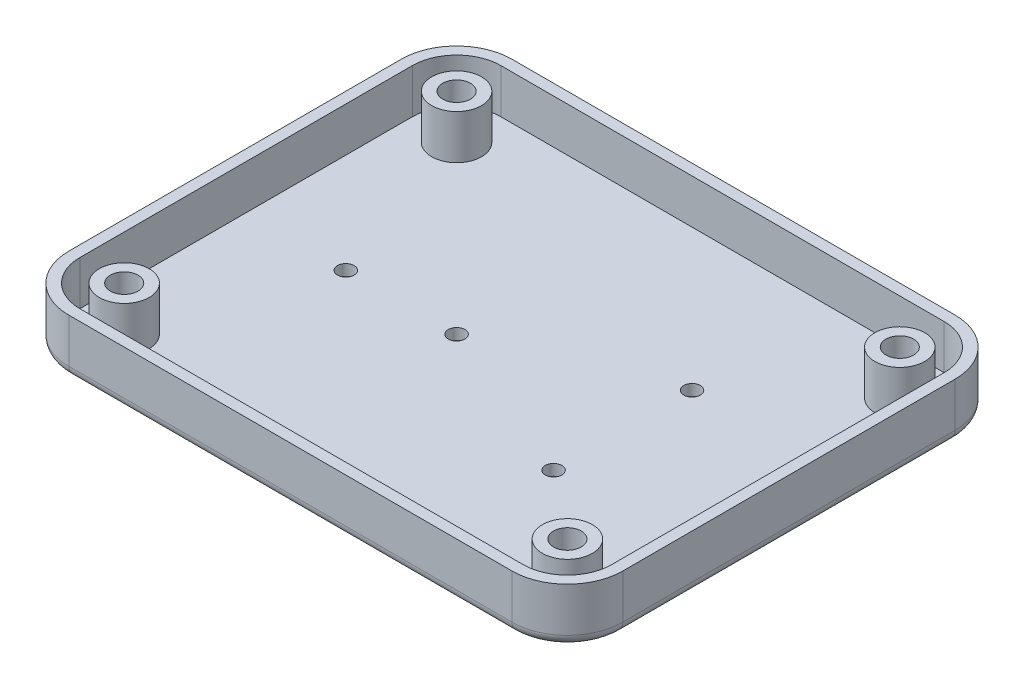
ISO-10303-21;
HEADER;
FILE_DESCRIPTION(('STEP AP214'),'2;1');
FILE_NAME('part.step','',(''),(''),'','','');
FILE_SCHEMA(('AUTOMOTIVE_DESIGN { 1 0 10303 214 1 1 1 1 }'));
ENDSEC;
DATA;
#1=APPLICATION_CONTEXT('core data for automotive mechanical design processes');
#2=APPLICATION_PROTOCOL_DEFINITION('international standard','automotive_design',2000,#1);
#3=PRODUCT_CONTEXT('',#1,'mechanical');
#4=PRODUCT('Part','Part','',(#3));
#5=PRODUCT_RELATED_PRODUCT_CATEGORY('part','',(#4));
#6=PRODUCT_DEFINITION_FORMATION('','',#4);
#7=PRODUCT_DEFINITION_CONTEXT('part definition',#1,'design');
#8=PRODUCT_DEFINITION('design','',#6,#7);
#9=PRODUCT_DEFINITION_SHAPE('','',#8);
#10=(LENGTH_UNIT() NAMED_UNIT(*) SI_UNIT(.MILLI.,.METRE.));
#11=(NAMED_UNIT(*) PLANE_ANGLE_UNIT() SI_UNIT($,.RADIAN.));
#12=(NAMED_UNIT(*) SI_UNIT($,.STERADIAN.) SOLID_ANGLE_UNIT());
#13=UNCERTAINTY_MEASURE_WITH_UNIT(LENGTH_MEASURE(1.E-05),#10,'distance_accuracy_value','');
#14=(GEOMETRIC_REPRESENTATION_CONTEXT(3) GLOBAL_UNCERTAINTY_ASSIGNED_CONTEXT((#13)) GLOBAL_UNIT_ASSIGNED_CONTEXT((#10,
#11,#12)) REPRESENTATION_CONTEXT('',''));
#15=CARTESIAN_POINT('',(0.,0.,0.));
#16=DIRECTION('',(0.,0.,1.));
#17=DIRECTION('',(1.,0.,0.));
#18=AXIS2_PLACEMENT_3D('',#15,#16,#17);
#19=CARTESIAN_POINT('',(0.,10.,0.));
#20=DIRECTION('',(0.,1.,0.));
#21=DIRECTION('',(0.,0.,1.));
#22=AXIS2_PLACEMENT_3D('',#19,#20,#21);
#23=PLANE('',#22);
#24=CARTESIAN_POINT('',(-40.,10.,30.));
#25=DIRECTION('',(0.,1.,0.));
#26=DIRECTION('',(0.,0.,1.));
#27=AXIS2_PLACEMENT_3D('',#24,#25,#26);
#28=CIRCLE('',#27,2.5);
#29=CARTESIAN_POINT('',(-40.,10.,32.5));
#30=VERTEX_POINT('',#29);
#31=EDGE_CURVE('E327',#30,#30,#28,.T.);
#32=ORIENTED_EDGE('',*,*,#31,.F.);
#33=EDGE_LOOP('',(#32));
#34=FACE_BOUND('',#33,.T.);
#35=CARTESIAN_POINT('',(-40.,10.,30.));
#36=DIRECTION('',(0.,1.,0.));
#37=DIRECTION('',(0.,0.,1.));
#38=AXIS2_PLACEMENT_3D('',#35,#36,#37);
#39=CIRCLE('',#38,4.5);
#40=CARTESIAN_POINT('',(-40.,10.,34.5));
#41=VERTEX_POINT('',#40);
#42=EDGE_CURVE('E236',#41,#41,#39,.T.);
#43=ORIENTED_EDGE('',*,*,#42,.T.);
#44=EDGE_LOOP('',(#43));
#45=FACE_BOUND('',#44,.T.);
#46=ADVANCED_FACE('F38',(#34,#45),#23,.T.);
#47=CARTESIAN_POINT('',(40.,10.,30.));
#48=DIRECTION('',(0.,1.,0.));
#49=DIRECTION('',(0.,0.,1.));
#50=AXIS2_PLACEMENT_3D('',#47,#48,#49);
#51=CIRCLE('',#50,2.5);
#52=CARTESIAN_POINT('',(40.,10.,32.5));
#53=VERTEX_POINT('',#52);
#54=EDGE_CURVE('E319',#53,#53,#51,.T.);
#55=ORIENTED_EDGE('',*,*,#54,.F.);
#56=EDGE_LOOP('',(#55));
#57=FACE_BOUND('',#56,.T.);
#58=CARTESIAN_POINT('',(40.,10.,30.));
#59=DIRECTION('',(0.,1.,0.));
#60=DIRECTION('',(0.,0.,1.));
#61=AXIS2_PLACEMENT_3D('',#58,#59,#60);
#62=CIRCLE('',#61,4.5);
#63=CARTESIAN_POINT('',(40.,10.,34.5));
#64=VERTEX_POINT('',#63);
#65=EDGE_CURVE('E235',#64,#64,#62,.T.);
#66=ORIENTED_EDGE('',*,*,#65,.T.);
#67=EDGE_LOOP('',(#66));
#68=FACE_BOUND('',#67,.T.);
#69=ADVANCED_FACE('F539',(#57,#68),#23,.T.);
#70=CARTESIAN_POINT('',(40.,10.,-30.));
#71=DIRECTION('',(0.,1.,0.));
#72=DIRECTION('',(0.,0.,1.));
#73=AXIS2_PLACEMENT_3D('',#70,#71,#72);
#74=CIRCLE('',#73,2.5);
#75=CARTESIAN_POINT('',(40.,10.,-27.5));
#76=VERTEX_POINT('',#75);
#77=EDGE_CURVE('E311',#76,#76,#74,.T.);
#78=ORIENTED_EDGE('',*,*,#77,.F.);
#79=EDGE_LOOP('',(#78));
#80=FACE_BOUND('',#79,.T.);
#81=CARTESIAN_POINT('',(40.,10.,-30.));
#82=DIRECTION('',(0.,1.,0.));
#83=DIRECTION('',(0.,0.,1.));
#84=AXIS2_PLACEMENT_3D('',#81,#82,#83);
#85=CIRCLE('',#84,4.5);
#86=CARTESIAN_POINT('',(40.,10.,-25.5));
#87=VERTEX_POINT('',#86);
#88=EDGE_CURVE('E241',#87,#87,#85,.T.);
#89=ORIENTED_EDGE('',*,*,#88,.T.);
#90=EDGE_LOOP('',(#89));
#91=FACE_BOUND('',#90,.T.);
#92=ADVANCED_FACE('F534',(#80,#91),#23,.T.);
#93=CARTESIAN_POINT('',(-40.,10.,-30.));
#94=DIRECTION('',(0.,1.,0.));
#95=DIRECTION('',(0.,0.,1.));
#96=AXIS2_PLACEMENT_3D('',#93,#94,#95);
#97=CIRCLE('',#96,2.5);
#98=CARTESIAN_POINT('',(-40.,10.,-27.5));
#99=VERTEX_POINT('',#98);
#100=EDGE_CURVE('E310',#99,#99,#97,.T.);
#101=ORIENTED_EDGE('',*,*,#100,.F.);
#102=EDGE_LOOP('',(#101));
#103=FACE_BOUND('',#102,.T.);
#104=CARTESIAN_POINT('',(-40.,10.,-30.));
#105=DIRECTION('',(0.,1.,0.));
#106=DIRECTION('',(0.,0.,1.));
#107=AXIS2_PLACEMENT_3D('',#104,#105,#106);
#108=CIRCLE('',#107,4.5);
#109=CARTESIAN_POINT('',(-40.,10.,-25.5));
#110=VERTEX_POINT('',#109);
#111=EDGE_CURVE('E246',#110,#110,#108,.T.);
#112=ORIENTED_EDGE('',*,*,#111,.T.);
#113=EDGE_LOOP('',(#112));
#114=FACE_BOUND('',#113,.T.);
#115=ADVANCED_FACE('F527',(#103,#114),#23,.T.);
#116=CARTESIAN_POINT('',(-50.,10.,40.));
#117=DIRECTION('',(1.,0.,0.));
#118=DIRECTION('',(0.,0.,-1.));
#119=AXIS2_PLACEMENT_3D('',#116,#117,#118);
#120=PLANE('',#119);
#121=DIRECTION('',(0.,-1.,0.));
#122=VECTOR('',#121,1.);
#123=CARTESIAN_POINT('',(-50.,10.,-30.));
#124=LINE('',#123,#122);
#125=CARTESIAN_POINT('',(-50.,10.,-30.));
#126=VERTEX_POINT('',#125);
#127=CARTESIAN_POINT('',(-50.,2.,-30.));
#128=VERTEX_POINT('',#127);
#129=EDGE_CURVE('E361',#126,#128,#124,.T.);
#130=ORIENTED_EDGE('',*,*,#129,.T.);
#131=DIRECTION('',(0.,0.,1.));
#132=VECTOR('',#131,1.);
#133=CARTESIAN_POINT('',(-50.,2.,40.));
#134=LINE('',#133,#132);
#135=CARTESIAN_POINT('',(-50.,2.,30.));
#136=VERTEX_POINT('',#135);
#137=EDGE_CURVE('E434',#128,#136,#134,.T.);
#138=ORIENTED_EDGE('',*,*,#137,.T.);
#139=DIRECTION('',(0.,-1.,0.));
#140=VECTOR('',#139,1.);
#141=CARTESIAN_POINT('',(-50.,10.,30.));
#142=LINE('',#141,#140);
#143=CARTESIAN_POINT('',(-50.,10.,30.));
#144=VERTEX_POINT('',#143);
#145=EDGE_CURVE('E365',#136,#144,#142,.F.);
#146=ORIENTED_EDGE('',*,*,#145,.T.);
#147=DIRECTION('',(0.,0.,1.));
#148=VECTOR('',#147,1.);
#149=CARTESIAN_POINT('',(-50.,10.,40.));
#150=LINE('',#149,#148);
#151=EDGE_CURVE('E335',#126,#144,#150,.T.);
#152=ORIENTED_EDGE('',*,*,#151,.F.);
#153=EDGE_LOOP('',(#130,#138,#146,#152));
#154=FACE_BOUND('',#153,.T.);
#155=ADVANCED_FACE('F525',(#154),#120,.F.);
#156=CARTESIAN_POINT('',(50.,10.,40.));
#157=DIRECTION('',(0.,0.,-1.));
#158=DIRECTION('',(-1.,0.,0.));
#159=AXIS2_PLACEMENT_3D('',#156,#157,#158);
#160=PLANE('',#159);
#161=DIRECTION('',(0.,-1.,0.));
#162=VECTOR('',#161,1.);
#163=CARTESIAN_POINT('',(-40.,10.,40.));
#164=LINE('',#163,#162);
#165=CARTESIAN_POINT('',(-40.,10.,40.));
#166=VERTEX_POINT('',#165);
#167=CARTESIAN_POINT('',(-40.,2.,40.));
#168=VERTEX_POINT('',#167);
#169=EDGE_CURVE('E357',#166,#168,#164,.T.);
#170=ORIENTED_EDGE('',*,*,#169,.T.);
#171=DIRECTION('',(1.,0.,0.));
#172=VECTOR('',#171,1.);
#173=CARTESIAN_POINT('',(50.,2.,40.));
#174=LINE('',#173,#172);
#175=CARTESIAN_POINT('',(40.,2.,40.));
#176=VERTEX_POINT('',#175);
#177=EDGE_CURVE('E428',#168,#176,#174,.T.);
#178=ORIENTED_EDGE('',*,*,#177,.T.);
#179=DIRECTION('',(0.,-1.,0.));
#180=VECTOR('',#179,1.);
#181=CARTESIAN_POINT('',(40.,10.,40.));
#182=LINE('',#181,#180);
#183=CARTESIAN_POINT('',(40.,10.,40.));
#184=VERTEX_POINT('',#183);
#185=EDGE_CURVE('E354',#176,#184,#182,.F.);
#186=ORIENTED_EDGE('',*,*,#185,.T.);
#187=DIRECTION('',(1.,0.,0.));
#188=VECTOR('',#187,1.);
#189=CARTESIAN_POINT('',(50.,10.,40.));
#190=LINE('',#189,#188);
#191=EDGE_CURVE('E342',#166,#184,#190,.T.);
#192=ORIENTED_EDGE('',*,*,#191,.F.);
#193=EDGE_LOOP('',(#170,#178,#186,#192));
#194=FACE_BOUND('',#193,.T.);
#195=ADVANCED_FACE('F484',(#194),#160,.F.);
#196=CARTESIAN_POINT('',(50.,10.,40.));
#197=DIRECTION('',(-1.,0.,0.));
#198=DIRECTION('',(0.,0.,1.));
#199=AXIS2_PLACEMENT_3D('',#196,#197,#198);
#200=PLANE('',#199);
#201=DIRECTION('',(0.,-1.,0.));
#202=VECTOR('',#201,1.);
#203=CARTESIAN_POINT('',(50.,10.,30.));
#204=LINE('',#203,#202);
#205=CARTESIAN_POINT('',(50.,10.,30.));
#206=VERTEX_POINT('',#205);
#207=CARTESIAN_POINT('',(50.,2.,30.));
#208=VERTEX_POINT('',#207);
#209=EDGE_CURVE('E383',#206,#208,#204,.T.);
#210=ORIENTED_EDGE('',*,*,#209,.T.);
#211=DIRECTION('',(0.,0.,-1.));
#212=VECTOR('',#211,1.);
#213=CARTESIAN_POINT('',(50.,2.,40.));
#214=LINE('',#213,#212);
#215=CARTESIAN_POINT('',(50.,2.,-30.));
#216=VERTEX_POINT('',#215);
#217=EDGE_CURVE('E422',#208,#216,#214,.T.);
#218=ORIENTED_EDGE('',*,*,#217,.T.);
#219=DIRECTION('',(0.,-1.,0.));
#220=VECTOR('',#219,1.);
#221=CARTESIAN_POINT('',(50.,10.,-30.));
#222=LINE('',#221,#220);
#223=CARTESIAN_POINT('',(50.,10.,-30.));
#224=VERTEX_POINT('',#223);
#225=EDGE_CURVE('E380',#216,#224,#222,.F.);
#226=ORIENTED_EDGE('',*,*,#225,.T.);
#227=DIRECTION('',(0.,0.,-1.));
#228=VECTOR('',#227,1.);
#229=CARTESIAN_POINT('',(50.,10.,40.));
#230=LINE('',#229,#228);
#231=EDGE_CURVE('E346',#206,#224,#230,.T.);
#232=ORIENTED_EDGE('',*,*,#231,.F.);
#233=EDGE_LOOP('',(#210,#218,#226,#232));
#234=FACE_BOUND('',#233,.T.);
#235=ADVANCED_FACE('F497',(#234),#200,.F.);
#236=CARTESIAN_POINT('',(50.,10.,-40.));
#237=DIRECTION('',(0.,0.,1.));
#238=DIRECTION('',(1.,0.,0.));
#239=AXIS2_PLACEMENT_3D('',#236,#237,#238);
#240=PLANE('',#239);
#241=DIRECTION('',(0.,-1.,0.));
#242=VECTOR('',#241,1.);
#243=CARTESIAN_POINT('',(40.,10.,-40.));
#244=LINE('',#243,#242);
#245=CARTESIAN_POINT('',(40.,10.,-40.));
#246=VERTEX_POINT('',#245);
#247=CARTESIAN_POINT('',(40.,2.,-40.));
#248=VERTEX_POINT('',#247);
#249=EDGE_CURVE('E390',#246,#248,#244,.T.);
#250=ORIENTED_EDGE('',*,*,#249,.T.);
#251=DIRECTION('',(-1.,0.,0.));
#252=VECTOR('',#251,1.);
#253=CARTESIAN_POINT('',(50.,2.,-40.));
#254=LINE('',#253,#252);
#255=CARTESIAN_POINT('',(-40.,2.,-40.));
#256=VERTEX_POINT('',#255);
#257=EDGE_CURVE('E11',#248,#256,#254,.T.);
#258=ORIENTED_EDGE('',*,*,#257,.T.);
#259=DIRECTION('',(0.,-1.,0.));
#260=VECTOR('',#259,1.);
#261=CARTESIAN_POINT('',(-40.,10.,-40.));
#262=LINE('',#261,#260);
#263=CARTESIAN_POINT('',(-40.,10.,-40.));
#264=VERTEX_POINT('',#263);
#265=EDGE_CURVE('E387',#256,#264,#262,.F.);
#266=ORIENTED_EDGE('',*,*,#265,.T.);
#267=DIRECTION('',(-1.,0.,0.));
#268=VECTOR('',#267,1.);
#269=CARTESIAN_POINT('',(50.,10.,-40.));
#270=LINE('',#269,#268);
#271=EDGE_CURVE('E350',#246,#264,#270,.T.);
#272=ORIENTED_EDGE('',*,*,#271,.F.);
#273=EDGE_LOOP('',(#250,#258,#266,#272));
#274=FACE_BOUND('',#273,.T.);
#275=ADVANCED_FACE('F517',(#274),#240,.F.);
#276=DIRECTION('',(0.,0.,1.));
#277=VECTOR('',#276,1.);
#278=CARTESIAN_POINT('',(-48.,10.,40.));
#279=LINE('',#278,#277);
#280=CARTESIAN_POINT('',(-48.,10.,-30.));
#281=VERTEX_POINT('',#280);
#282=CARTESIAN_POINT('',(-48.,10.,30.));
#283=VERTEX_POINT('',#282);
#284=EDGE_CURVE('E251',#281,#283,#279,.T.);
#285=ORIENTED_EDGE('',*,*,#284,.F.);
#286=CARTESIAN_POINT('',(-40.,10.,-30.));
#287=DIRECTION('',(0.,1.,0.));
#288=DIRECTION('',(0.,0.,1.));
#289=AXIS2_PLACEMENT_3D('',#286,#287,#288);
#290=CIRCLE('',#289,8.);
#291=CARTESIAN_POINT('',(-40.,10.,-38.));
#292=VERTEX_POINT('',#291);
#293=EDGE_CURVE('E183',#292,#281,#290,.T.);
#294=ORIENTED_EDGE('',*,*,#293,.F.);
#295=DIRECTION('',(-1.,0.,0.));
#296=VECTOR('',#295,1.);
#297=CARTESIAN_POINT('',(50.,10.,-38.));
#298=LINE('',#297,#296);
#299=CARTESIAN_POINT('',(40.,10.,-38.));
#300=VERTEX_POINT('',#299);
#301=EDGE_CURVE('E56',#300,#292,#298,.T.);
#302=ORIENTED_EDGE('',*,*,#301,.F.);
#303=CARTESIAN_POINT('',(40.,10.,-30.));
#304=DIRECTION('',(0.,1.,0.));
#305=DIRECTION('',(0.,0.,1.));
#306=AXIS2_PLACEMENT_3D('',#303,#304,#305);
#307=CIRCLE('',#306,8.);
#308=CARTESIAN_POINT('',(48.,10.,-30.));
#309=VERTEX_POINT('',#308);
#310=EDGE_CURVE('E283',#309,#300,#307,.T.);
#311=ORIENTED_EDGE('',*,*,#310,.F.);
#312=DIRECTION('',(0.,0.,-1.));
#313=VECTOR('',#312,1.);
#314=CARTESIAN_POINT('',(48.,10.,40.));
#315=LINE('',#314,#313);
#316=CARTESIAN_POINT('',(48.,10.,30.));
#317=VERTEX_POINT('',#316);
#318=EDGE_CURVE('E280',#317,#309,#315,.T.);
#319=ORIENTED_EDGE('',*,*,#318,.F.);
#320=CARTESIAN_POINT('',(40.,10.,30.));
#321=DIRECTION('',(0.,1.,0.));
#322=DIRECTION('',(0.,0.,1.));
#323=AXIS2_PLACEMENT_3D('',#320,#321,#322);
#324=CIRCLE('',#323,8.);
#325=CARTESIAN_POINT('',(40.,10.,38.));
#326=VERTEX_POINT('',#325);
#327=EDGE_CURVE('E276',#326,#317,#324,.T.);
#328=ORIENTED_EDGE('',*,*,#327,.F.);
#329=DIRECTION('',(1.,0.,0.));
#330=VECTOR('',#329,1.);
#331=CARTESIAN_POINT('',(50.,10.,38.));
#332=LINE('',#331,#330);
#333=CARTESIAN_POINT('',(-40.,10.,38.));
#334=VERTEX_POINT('',#333);
#335=EDGE_CURVE('E273',#334,#326,#332,.T.);
#336=ORIENTED_EDGE('',*,*,#335,.F.);
#337=CARTESIAN_POINT('',(-40.,10.,30.));
#338=DIRECTION('',(0.,1.,0.));
#339=DIRECTION('',(0.,0.,1.));
#340=AXIS2_PLACEMENT_3D('',#337,#338,#339);
#341=CIRCLE('',#340,8.);
#342=EDGE_CURVE('E266',#283,#334,#341,.T.);
#343=ORIENTED_EDGE('',*,*,#342,.F.);
#344=EDGE_LOOP('',(#285,#294,#302,#311,#319,#328,#336,#343));
#345=FACE_BOUND('',#344,.T.);
#346=ORIENTED_EDGE('',*,*,#151,.T.);
#347=CARTESIAN_POINT('',(-40.,10.,30.));
#348=DIRECTION('',(0.,1.,0.));
#349=DIRECTION('',(0.,0.,1.));
#350=AXIS2_PLACEMENT_3D('',#347,#348,#349);
#351=CIRCLE('',#350,10.);
#352=EDGE_CURVE('E377',#144,#166,#351,.T.);
#353=ORIENTED_EDGE('',*,*,#352,.T.);
#354=ORIENTED_EDGE('',*,*,#191,.T.);
#355=CARTESIAN_POINT('',(40.,10.,30.));
#356=DIRECTION('',(0.,1.,0.));
#357=DIRECTION('',(0.,0.,1.));
#358=AXIS2_PLACEMENT_3D('',#355,#356,#357);
#359=CIRCLE('',#358,10.);
#360=EDGE_CURVE('E374',#184,#206,#359,.T.);
#361=ORIENTED_EDGE('',*,*,#360,.T.);
#362=ORIENTED_EDGE('',*,*,#231,.T.);
#363=CARTESIAN_POINT('',(40.,10.,-30.));
#364=DIRECTION('',(0.,1.,0.));
#365=DIRECTION('',(0.,0.,1.));
#366=AXIS2_PLACEMENT_3D('',#363,#364,#365);
#367=CIRCLE('',#366,10.);
#368=EDGE_CURVE('E371',#224,#246,#367,.T.);
#369=ORIENTED_EDGE('',*,*,#368,.T.);
#370=ORIENTED_EDGE('',*,*,#271,.T.);
#371=CARTESIAN_POINT('',(-40.,10.,-30.));
#372=DIRECTION('',(0.,1.,0.));
#373=DIRECTION('',(0.,0.,1.));
#374=AXIS2_PLACEMENT_3D('',#371,#372,#373);
#375=CIRCLE('',#374,10.);
#376=EDGE_CURVE('E368',#264,#126,#375,.T.);
#377=ORIENTED_EDGE('',*,*,#376,.T.);
#378=EDGE_LOOP('',(#346,#353,#354,#361,#362,#369,#370,#377));
#379=FACE_BOUND('',#378,.T.);
#380=ADVANCED_FACE('F488',(#345,#379),#23,.T.);
#381=CARTESIAN_POINT('',(0.,0.,0.));
#382=DIRECTION('',(0.,1.,0.));
#383=DIRECTION('',(0.,0.,1.));
#384=AXIS2_PLACEMENT_3D('',#381,#382,#383);
#385=PLANE('',#384);
#386=CARTESIAN_POINT('',(-30.,0.,0.));
#387=DIRECTION('',(0.,1.,0.));
#388=DIRECTION('',(0.,0.,1.));
#389=AXIS2_PLACEMENT_3D('',#386,#387,#388);
#390=CIRCLE('',#389,1.5);
#391=CARTESIAN_POINT('',(-30.,0.,1.5));
#392=VERTEX_POINT('',#391);
#393=EDGE_CURVE('E305',#392,#392,#390,.T.);
#394=ORIENTED_EDGE('',*,*,#393,.T.);
#395=EDGE_LOOP('',(#394));
#396=FACE_BOUND('',#395,.T.);
#397=CARTESIAN_POINT('',(-10.,0.,0.));
#398=DIRECTION('',(0.,1.,0.));
#399=DIRECTION('',(0.,0.,1.));
#400=AXIS2_PLACEMENT_3D('',#397,#398,#399);
#401=CIRCLE('',#400,1.5);
#402=CARTESIAN_POINT('',(-10.,0.,1.5));
#403=VERTEX_POINT('',#402);
#404=EDGE_CURVE('E870',#403,#403,#401,.T.);
#405=ORIENTED_EDGE('',*,*,#404,.T.);
#406=EDGE_LOOP('',(#405));
#407=FACE_BOUND('',#406,.T.);
#408=CARTESIAN_POINT('',(20.,0.,-12.5));
#409=DIRECTION('',(0.,1.,0.));
#410=DIRECTION('',(0.,0.,1.));
#411=AXIS2_PLACEMENT_3D('',#408,#409,#410);
#412=CIRCLE('',#411,1.5);
#413=CARTESIAN_POINT('',(20.,0.,-11.));
#414=VERTEX_POINT('',#413);
#415=EDGE_CURVE('E882',#414,#414,#412,.T.);
#416=ORIENTED_EDGE('',*,*,#415,.T.);
#417=EDGE_LOOP('',(#416));
#418=FACE_BOUND('',#417,.T.);
#419=CARTESIAN_POINT('',(20.,0.,12.5));
#420=DIRECTION('',(0.,1.,0.));
#421=DIRECTION('',(0.,0.,1.));
#422=AXIS2_PLACEMENT_3D('',#419,#420,#421);
#423=CIRCLE('',#422,1.5);
#424=CARTESIAN_POINT('',(20.,0.,14.));
#425=VERTEX_POINT('',#424);
#426=EDGE_CURVE('E890',#425,#425,#423,.T.);
#427=ORIENTED_EDGE('',*,*,#426,.T.);
#428=EDGE_LOOP('',(#427));
#429=FACE_BOUND('',#428,.T.);
#430=DIRECTION('',(-1.,0.,0.));
#431=VECTOR('',#430,1.);
#432=CARTESIAN_POINT('',(0.,0.,-38.));
#433=LINE('',#432,#431);
#434=CARTESIAN_POINT('',(-40.,0.,-38.));
#435=VERTEX_POINT('',#434);
#436=CARTESIAN_POINT('',(40.,0.,-38.));
#437=VERTEX_POINT('',#436);
#438=EDGE_CURVE('E393',#435,#437,#433,.F.);
#439=ORIENTED_EDGE('',*,*,#438,.T.);
#440=CARTESIAN_POINT('',(40.,0.,-30.));
#441=DIRECTION('',(0.,1.,0.));
#442=DIRECTION('',(0.,0.,1.));
#443=AXIS2_PLACEMENT_3D('',#440,#441,#442);
#444=CIRCLE('',#443,8.);
#445=CARTESIAN_POINT('',(48.,0.,-30.));
#446=VERTEX_POINT('',#445);
#447=EDGE_CURVE('E414',#437,#446,#444,.F.);
#448=ORIENTED_EDGE('',*,*,#447,.T.);
#449=DIRECTION('',(0.,0.,-1.));
#450=VECTOR('',#449,1.);
#451=CARTESIAN_POINT('',(48.,0.,0.));
#452=LINE('',#451,#450);
#453=CARTESIAN_POINT('',(48.,0.,30.));
#454=VERTEX_POINT('',#453);
#455=EDGE_CURVE('E411',#446,#454,#452,.F.);
#456=ORIENTED_EDGE('',*,*,#455,.T.);
#457=CARTESIAN_POINT('',(40.,0.,30.));
#458=DIRECTION('',(0.,1.,0.));
#459=DIRECTION('',(0.,0.,1.));
#460=AXIS2_PLACEMENT_3D('',#457,#458,#459);
#461=CIRCLE('',#460,8.);
#462=CARTESIAN_POINT('',(40.,0.,38.));
#463=VERTEX_POINT('',#462);
#464=EDGE_CURVE('E408',#454,#463,#461,.F.);
#465=ORIENTED_EDGE('',*,*,#464,.T.);
#466=DIRECTION('',(1.,0.,0.));
#467=VECTOR('',#466,1.);
#468=CARTESIAN_POINT('',(0.,0.,38.));
#469=LINE('',#468,#467);
#470=CARTESIAN_POINT('',(-40.,0.,38.));
#471=VERTEX_POINT('',#470);
#472=EDGE_CURVE('E405',#463,#471,#469,.F.);
#473=ORIENTED_EDGE('',*,*,#472,.T.);
#474=CARTESIAN_POINT('',(-40.,0.,30.));
#475=DIRECTION('',(0.,1.,0.));
#476=DIRECTION('',(0.,0.,1.));
#477=AXIS2_PLACEMENT_3D('',#474,#475,#476);
#478=CIRCLE('',#477,8.);
#479=CARTESIAN_POINT('',(-48.,0.,30.));
#480=VERTEX_POINT('',#479);
#481=EDGE_CURVE('E402',#471,#480,#478,.F.);
#482=ORIENTED_EDGE('',*,*,#481,.T.);
#483=DIRECTION('',(0.,0.,1.));
#484=VECTOR('',#483,1.);
#485=CARTESIAN_POINT('',(-48.,0.,0.));
#486=LINE('',#485,#484);
#487=CARTESIAN_POINT('',(-48.,0.,-30.));
#488=VERTEX_POINT('',#487);
#489=EDGE_CURVE('E399',#480,#488,#486,.F.);
#490=ORIENTED_EDGE('',*,*,#489,.T.);
#491=CARTESIAN_POINT('',(-40.,0.,-30.));
#492=DIRECTION('',(0.,1.,0.));
#493=DIRECTION('',(0.,0.,1.));
#494=AXIS2_PLACEMENT_3D('',#491,#492,#493);
#495=CIRCLE('',#494,8.);
#496=EDGE_CURVE('E396',#488,#435,#495,.F.);
#497=ORIENTED_EDGE('',*,*,#496,.T.);
#498=EDGE_LOOP('',(#439,#448,#456,#465,#473,#482,#490,#497));
#499=FACE_BOUND('',#498,.T.);
#500=CARTESIAN_POINT('',(-40.,0.,30.));
#501=DIRECTION('',(0.,1.,0.));
#502=DIRECTION('',(0.,0.,1.));
#503=AXIS2_PLACEMENT_3D('',#500,#501,#502);
#504=CIRCLE('',#503,2.5);
#505=CARTESIAN_POINT('',(-40.,0.,32.5));
#506=VERTEX_POINT('',#505);
#507=EDGE_CURVE('E323',#506,#506,#504,.T.);
#508=ORIENTED_EDGE('',*,*,#507,.T.);
#509=EDGE_LOOP('',(#508));
#510=FACE_BOUND('',#509,.T.);
#511=CARTESIAN_POINT('',(40.,0.,30.));
#512=DIRECTION('',(0.,1.,0.));
#513=DIRECTION('',(0.,0.,1.));
#514=AXIS2_PLACEMENT_3D('',#511,#512,#513);
#515=CIRCLE('',#514,2.5);
#516=CARTESIAN_POINT('',(40.,0.,32.5));
#517=VERTEX_POINT('',#516);
#518=EDGE_CURVE('E315',#517,#517,#515,.T.);
#519=ORIENTED_EDGE('',*,*,#518,.T.);
#520=EDGE_LOOP('',(#519));
#521=FACE_BOUND('',#520,.T.);
#522=CARTESIAN_POINT('',(40.,0.,-30.));
#523=DIRECTION('',(0.,1.,0.));
#524=DIRECTION('',(0.,0.,1.));
#525=AXIS2_PLACEMENT_3D('',#522,#523,#524);
#526=CIRCLE('',#525,2.5);
#527=CARTESIAN_POINT('',(40.,0.,-27.5));
#528=VERTEX_POINT('',#527);
#529=EDGE_CURVE('E306',#528,#528,#526,.T.);
#530=ORIENTED_EDGE('',*,*,#529,.T.);
#531=EDGE_LOOP('',(#530));
#532=FACE_BOUND('',#531,.T.);
#533=CARTESIAN_POINT('',(-40.,0.,-30.));
#534=DIRECTION('',(0.,1.,0.));
#535=DIRECTION('',(0.,0.,1.));
#536=AXIS2_PLACEMENT_3D('',#533,#534,#535);
#537=CIRCLE('',#536,2.5);
#538=CARTESIAN_POINT('',(-40.,0.,-27.5));
#539=VERTEX_POINT('',#538);
#540=EDGE_CURVE('E331',#539,#539,#537,.T.);
#541=ORIENTED_EDGE('',*,*,#540,.T.);
#542=EDGE_LOOP('',(#541));
#543=FACE_BOUND('',#542,.T.);
#544=ADVANCED_FACE('F550',(#396,#407,#418,#429,#499,#510,#521,#532,#543),#385,.F.);
#545=CARTESIAN_POINT('',(-40.,10.,30.));
#546=DIRECTION('',(0.,-1.,0.));
#547=DIRECTION('',(0.,0.,-1.));
#548=AXIS2_PLACEMENT_3D('',#545,#546,#547);
#549=CYLINDRICAL_SURFACE('',#548,10.);
#550=ORIENTED_EDGE('',*,*,#145,.F.);
#551=CARTESIAN_POINT('',(-40.,2.,30.));
#552=DIRECTION('',(0.,1.,0.));
#553=DIRECTION('',(0.,0.,1.));
#554=AXIS2_PLACEMENT_3D('',#551,#552,#553);
#555=CIRCLE('',#554,10.);
#556=EDGE_CURVE('E431',#136,#168,#555,.T.);
#557=ORIENTED_EDGE('',*,*,#556,.T.);
#558=ORIENTED_EDGE('',*,*,#169,.F.);
#559=ORIENTED_EDGE('',*,*,#352,.F.);
#560=EDGE_LOOP('',(#550,#557,#558,#559));
#561=FACE_BOUND('',#560,.T.);
#562=ADVANCED_FACE('F480',(#561),#549,.T.);
#563=CARTESIAN_POINT('',(40.,10.,30.));
#564=DIRECTION('',(0.,-1.,0.));
#565=DIRECTION('',(0.,0.,-1.));
#566=AXIS2_PLACEMENT_3D('',#563,#564,#565);
#567=CYLINDRICAL_SURFACE('',#566,10.);
#568=ORIENTED_EDGE('',*,*,#185,.F.);
#569=CARTESIAN_POINT('',(40.,2.,30.));
#570=DIRECTION('',(0.,1.,0.));
#571=DIRECTION('',(0.,0.,1.));
#572=AXIS2_PLACEMENT_3D('',#569,#570,#571);
#573=CIRCLE('',#572,10.);
#574=EDGE_CURVE('E425',#176,#208,#573,.T.);
#575=ORIENTED_EDGE('',*,*,#574,.T.);
#576=ORIENTED_EDGE('',*,*,#209,.F.);
#577=ORIENTED_EDGE('',*,*,#360,.F.);
#578=EDGE_LOOP('',(#568,#575,#576,#577));
#579=FACE_BOUND('',#578,.T.);
#580=ADVANCED_FACE('F492',(#579),#567,.T.);
#581=CARTESIAN_POINT('',(40.,10.,-30.));
#582=DIRECTION('',(0.,-1.,0.));
#583=DIRECTION('',(0.,0.,-1.));
#584=AXIS2_PLACEMENT_3D('',#581,#582,#583);
#585=CYLINDRICAL_SURFACE('',#584,10.);
#586=ORIENTED_EDGE('',*,*,#225,.F.);
#587=CARTESIAN_POINT('',(40.,2.,-30.));
#588=DIRECTION('',(0.,1.,0.));
#589=DIRECTION('',(0.,0.,1.));
#590=AXIS2_PLACEMENT_3D('',#587,#588,#589);
#591=CIRCLE('',#590,10.);
#592=EDGE_CURVE('E418',#216,#248,#591,.T.);
#593=ORIENTED_EDGE('',*,*,#592,.T.);
#594=ORIENTED_EDGE('',*,*,#249,.F.);
#595=ORIENTED_EDGE('',*,*,#368,.F.);
#596=EDGE_LOOP('',(#586,#593,#594,#595));
#597=FACE_BOUND('',#596,.T.);
#598=ADVANCED_FACE('F514',(#597),#585,.T.);
#599=CARTESIAN_POINT('',(-40.,10.,-30.));
#600=DIRECTION('',(0.,-1.,0.));
#601=DIRECTION('',(0.,0.,-1.));
#602=AXIS2_PLACEMENT_3D('',#599,#600,#601);
#603=CYLINDRICAL_SURFACE('',#602,10.);
#604=ORIENTED_EDGE('',*,*,#265,.F.);
#605=CARTESIAN_POINT('',(-40.,2.,-30.));
#606=DIRECTION('',(0.,1.,0.));
#607=DIRECTION('',(0.,0.,1.));
#608=AXIS2_PLACEMENT_3D('',#605,#606,#607);
#609=CIRCLE('',#608,10.);
#610=EDGE_CURVE('E48',#256,#128,#609,.T.);
#611=ORIENTED_EDGE('',*,*,#610,.T.);
#612=ORIENTED_EDGE('',*,*,#129,.F.);
#613=ORIENTED_EDGE('',*,*,#376,.F.);
#614=EDGE_LOOP('',(#604,#611,#612,#613));
#615=FACE_BOUND('',#614,.T.);
#616=ADVANCED_FACE('F522',(#615),#603,.T.);
#617=CARTESIAN_POINT('',(-40.,0.,-30.));
#618=DIRECTION('',(0.,1.,0.));
#619=DIRECTION('',(0.,0.,1.));
#620=AXIS2_PLACEMENT_3D('',#617,#618,#619);
#621=CYLINDRICAL_SURFACE('',#620,2.5);
#622=ORIENTED_EDGE('',*,*,#540,.F.);
#623=EDGE_LOOP('',(#622));
#624=FACE_BOUND('',#623,.T.);
#625=ORIENTED_EDGE('',*,*,#100,.T.);
#626=EDGE_LOOP('',(#625));
#627=FACE_BOUND('',#626,.T.);
#628=ADVANCED_FACE('F621',(#624,#627),#621,.F.);
#629=CARTESIAN_POINT('',(40.,0.,-30.));
#630=DIRECTION('',(0.,1.,0.));
#631=DIRECTION('',(0.,0.,1.));
#632=AXIS2_PLACEMENT_3D('',#629,#630,#631);
#633=CYLINDRICAL_SURFACE('',#632,2.5);
#634=ORIENTED_EDGE('',*,*,#529,.F.);
#635=EDGE_LOOP('',(#634));
#636=FACE_BOUND('',#635,.T.);
#637=ORIENTED_EDGE('',*,*,#77,.T.);
#638=EDGE_LOOP('',(#637));
#639=FACE_BOUND('',#638,.T.);
#640=ADVANCED_FACE('F617',(#636,#639),#633,.F.);
#641=CARTESIAN_POINT('',(40.,0.,30.));
#642=DIRECTION('',(0.,1.,0.));
#643=DIRECTION('',(0.,0.,1.));
#644=AXIS2_PLACEMENT_3D('',#641,#642,#643);
#645=CYLINDRICAL_SURFACE('',#644,2.5);
#646=ORIENTED_EDGE('',*,*,#518,.F.);
#647=EDGE_LOOP('',(#646));
#648=FACE_BOUND('',#647,.T.);
#649=ORIENTED_EDGE('',*,*,#54,.T.);
#650=EDGE_LOOP('',(#649));
#651=FACE_BOUND('',#650,.T.);
#652=ADVANCED_FACE('F620',(#648,#651),#645,.F.);
#653=CARTESIAN_POINT('',(-40.,0.,30.));
#654=DIRECTION('',(0.,1.,0.));
#655=DIRECTION('',(0.,0.,1.));
#656=AXIS2_PLACEMENT_3D('',#653,#654,#655);
#657=CYLINDRICAL_SURFACE('',#656,2.5);
#658=ORIENTED_EDGE('',*,*,#507,.F.);
#659=EDGE_LOOP('',(#658));
#660=FACE_BOUND('',#659,.T.);
#661=ORIENTED_EDGE('',*,*,#31,.T.);
#662=EDGE_LOOP('',(#661));
#663=FACE_BOUND('',#662,.T.);
#664=ADVANCED_FACE('F625',(#660,#663),#657,.F.);
#665=CARTESIAN_POINT('',(-40.,2.,30.));
#666=DIRECTION('',(0.,1.,0.));
#667=DIRECTION('',(0.,0.,1.));
#668=AXIS2_PLACEMENT_3D('',#665,#666,#667);
#669=TOROIDAL_SURFACE('',#668,8.,2.);
#670=CARTESIAN_POINT('',(-40.,2.,38.));
#671=DIRECTION('',(1.,0.,0.));
#672=DIRECTION('',(0.,0.,-1.));
#673=AXIS2_PLACEMENT_3D('',#670,#671,#672);
#674=CIRCLE('',#673,2.);
#675=EDGE_CURVE('E459',#168,#471,#674,.T.);
#676=ORIENTED_EDGE('',*,*,#675,.F.);
#677=ORIENTED_EDGE('',*,*,#556,.F.);
#678=CARTESIAN_POINT('',(-48.,2.,30.));
#679=DIRECTION('',(0.,0.,-1.));
#680=DIRECTION('',(-1.,0.,0.));
#681=AXIS2_PLACEMENT_3D('',#678,#679,#680);
#682=CIRCLE('',#681,2.);
#683=EDGE_CURVE('E42',#480,#136,#682,.T.);
#684=ORIENTED_EDGE('',*,*,#683,.F.);
#685=ORIENTED_EDGE('',*,*,#481,.F.);
#686=EDGE_LOOP('',(#676,#677,#684,#685));
#687=FACE_BOUND('',#686,.T.);
#688=ADVANCED_FACE('F40',(#687),#669,.T.);
#689=CARTESIAN_POINT('',(-48.,2.,40.));
#690=DIRECTION('',(0.,0.,1.));
#691=DIRECTION('',(1.,0.,0.));
#692=AXIS2_PLACEMENT_3D('',#689,#690,#691);
#693=CYLINDRICAL_SURFACE('',#692,2.);
#694=ORIENTED_EDGE('',*,*,#683,.T.);
#695=ORIENTED_EDGE('',*,*,#137,.F.);
#696=CARTESIAN_POINT('',(-48.,2.,-30.));
#697=DIRECTION('',(0.,0.,-1.));
#698=DIRECTION('',(-1.,0.,0.));
#699=AXIS2_PLACEMENT_3D('',#696,#697,#698);
#700=CIRCLE('',#699,2.);
#701=EDGE_CURVE('E456',#488,#128,#700,.T.);
#702=ORIENTED_EDGE('',*,*,#701,.F.);
#703=ORIENTED_EDGE('',*,*,#489,.F.);
#704=EDGE_LOOP('',(#694,#695,#702,#703));
#705=FACE_BOUND('',#704,.T.);
#706=ADVANCED_FACE('F472',(#705),#693,.T.);
#707=CARTESIAN_POINT('',(50.,2.,38.));
#708=DIRECTION('',(1.,0.,0.));
#709=DIRECTION('',(0.,0.,-1.));
#710=AXIS2_PLACEMENT_3D('',#707,#708,#709);
#711=CYLINDRICAL_SURFACE('',#710,2.);
#712=ORIENTED_EDGE('',*,*,#675,.T.);
#713=ORIENTED_EDGE('',*,*,#472,.F.);
#714=CARTESIAN_POINT('',(40.,2.,38.));
#715=DIRECTION('',(1.,0.,0.));
#716=DIRECTION('',(0.,0.,-1.));
#717=AXIS2_PLACEMENT_3D('',#714,#715,#716);
#718=CIRCLE('',#717,2.);
#719=EDGE_CURVE('E452',#176,#463,#718,.T.);
#720=ORIENTED_EDGE('',*,*,#719,.F.);
#721=ORIENTED_EDGE('',*,*,#177,.F.);
#722=EDGE_LOOP('',(#712,#713,#720,#721));
#723=FACE_BOUND('',#722,.T.);
#724=ADVANCED_FACE('F661',(#723),#711,.T.);
#725=CARTESIAN_POINT('',(-40.,2.,-30.));
#726=DIRECTION('',(0.,1.,0.));
#727=DIRECTION('',(0.,0.,1.));
#728=AXIS2_PLACEMENT_3D('',#725,#726,#727);
#729=TOROIDAL_SURFACE('',#728,8.,2.);
#730=ORIENTED_EDGE('',*,*,#701,.T.);
#731=ORIENTED_EDGE('',*,*,#610,.F.);
#732=CARTESIAN_POINT('',(-40.,2.,-38.));
#733=DIRECTION('',(1.,0.,0.));
#734=DIRECTION('',(0.,0.,-1.));
#735=AXIS2_PLACEMENT_3D('',#732,#733,#734);
#736=CIRCLE('',#735,2.);
#737=EDGE_CURVE('E448',#435,#256,#736,.T.);
#738=ORIENTED_EDGE('',*,*,#737,.F.);
#739=ORIENTED_EDGE('',*,*,#496,.F.);
#740=EDGE_LOOP('',(#730,#731,#738,#739));
#741=FACE_BOUND('',#740,.T.);
#742=ADVANCED_FACE('F658',(#741),#729,.T.);
#743=CARTESIAN_POINT('',(40.,2.,30.));
#744=DIRECTION('',(0.,1.,0.));
#745=DIRECTION('',(0.,0.,1.));
#746=AXIS2_PLACEMENT_3D('',#743,#744,#745);
#747=TOROIDAL_SURFACE('',#746,8.,2.);
#748=ORIENTED_EDGE('',*,*,#719,.T.);
#749=ORIENTED_EDGE('',*,*,#464,.F.);
#750=CARTESIAN_POINT('',(48.,2.,30.));
#751=DIRECTION('',(0.,0.,-1.));
#752=DIRECTION('',(-1.,0.,0.));
#753=AXIS2_PLACEMENT_3D('',#750,#751,#752);
#754=CIRCLE('',#753,2.);
#755=EDGE_CURVE('E444',#208,#454,#754,.T.);
#756=ORIENTED_EDGE('',*,*,#755,.F.);
#757=ORIENTED_EDGE('',*,*,#574,.F.);
#758=EDGE_LOOP('',(#748,#749,#756,#757));
#759=FACE_BOUND('',#758,.T.);
#760=ADVANCED_FACE('F502',(#759),#747,.T.);
#761=CARTESIAN_POINT('',(50.,2.,-38.));
#762=DIRECTION('',(-1.,0.,0.));
#763=DIRECTION('',(0.,0.,1.));
#764=AXIS2_PLACEMENT_3D('',#761,#762,#763);
#765=CYLINDRICAL_SURFACE('',#764,2.);
#766=ORIENTED_EDGE('',*,*,#737,.T.);
#767=ORIENTED_EDGE('',*,*,#257,.F.);
#768=CARTESIAN_POINT('',(40.,2.,-38.));
#769=DIRECTION('',(1.,0.,0.));
#770=DIRECTION('',(0.,0.,-1.));
#771=AXIS2_PLACEMENT_3D('',#768,#769,#770);
#772=CIRCLE('',#771,2.);
#773=EDGE_CURVE('E441',#437,#248,#772,.T.);
#774=ORIENTED_EDGE('',*,*,#773,.F.);
#775=ORIENTED_EDGE('',*,*,#438,.F.);
#776=EDGE_LOOP('',(#766,#767,#774,#775));
#777=FACE_BOUND('',#776,.T.);
#778=ADVANCED_FACE('F652',(#777),#765,.T.);
#779=CARTESIAN_POINT('',(48.,2.,40.));
#780=DIRECTION('',(0.,0.,-1.));
#781=DIRECTION('',(-1.,0.,0.));
#782=AXIS2_PLACEMENT_3D('',#779,#780,#781);
#783=CYLINDRICAL_SURFACE('',#782,2.);
#784=ORIENTED_EDGE('',*,*,#755,.T.);
#785=ORIENTED_EDGE('',*,*,#455,.F.);
#786=CARTESIAN_POINT('',(48.,2.,-30.));
#787=DIRECTION('',(0.,0.,-1.));
#788=DIRECTION('',(-1.,0.,0.));
#789=AXIS2_PLACEMENT_3D('',#786,#787,#788);
#790=CIRCLE('',#789,2.);
#791=EDGE_CURVE('E218',#216,#446,#790,.T.);
#792=ORIENTED_EDGE('',*,*,#791,.F.);
#793=ORIENTED_EDGE('',*,*,#217,.F.);
#794=EDGE_LOOP('',(#784,#785,#792,#793));
#795=FACE_BOUND('',#794,.T.);
#796=ADVANCED_FACE('F506',(#795),#783,.T.);
#797=CARTESIAN_POINT('',(40.,2.,-30.));
#798=DIRECTION('',(0.,1.,0.));
#799=DIRECTION('',(0.,0.,1.));
#800=AXIS2_PLACEMENT_3D('',#797,#798,#799);
#801=TOROIDAL_SURFACE('',#800,8.,2.);
#802=ORIENTED_EDGE('',*,*,#773,.T.);
#803=ORIENTED_EDGE('',*,*,#592,.F.);
#804=ORIENTED_EDGE('',*,*,#791,.T.);
#805=ORIENTED_EDGE('',*,*,#447,.F.);
#806=EDGE_LOOP('',(#802,#803,#804,#805));
#807=FACE_BOUND('',#806,.T.);
#808=ADVANCED_FACE('F510',(#807),#801,.T.);
#809=CARTESIAN_POINT('',(-48.,10.,40.));
#810=DIRECTION('',(1.,0.,0.));
#811=DIRECTION('',(0.,0.,-1.));
#812=AXIS2_PLACEMENT_3D('',#809,#810,#811);
#813=PLANE('',#812);
#814=DIRECTION('',(0.,1.,0.));
#815=VECTOR('',#814,1.);
#816=CARTESIAN_POINT('',(-48.,10.,-30.));
#817=LINE('',#816,#815);
#818=CARTESIAN_POINT('',(-48.,2.,-30.));
#819=VERTEX_POINT('',#818);
#820=EDGE_CURVE('E178',#281,#819,#817,.F.);
#821=ORIENTED_EDGE('',*,*,#820,.F.);
#822=ORIENTED_EDGE('',*,*,#284,.T.);
#823=DIRECTION('',(0.,1.,0.));
#824=VECTOR('',#823,1.);
#825=CARTESIAN_POINT('',(-48.,10.,30.));
#826=LINE('',#825,#824);
#827=CARTESIAN_POINT('',(-48.,2.,30.));
#828=VERTEX_POINT('',#827);
#829=EDGE_CURVE('E189',#828,#283,#826,.T.);
#830=ORIENTED_EDGE('',*,*,#829,.F.);
#831=DIRECTION('',(0.,0.,1.));
#832=VECTOR('',#831,1.);
#833=CARTESIAN_POINT('',(-48.,2.,40.));
#834=LINE('',#833,#832);
#835=EDGE_CURVE('E198',#819,#828,#834,.T.);
#836=ORIENTED_EDGE('',*,*,#835,.F.);
#837=EDGE_LOOP('',(#821,#822,#830,#836));
#838=FACE_BOUND('',#837,.T.);
#839=ADVANCED_FACE('F205',(#838),#813,.T.);
#840=CARTESIAN_POINT('',(50.,10.,38.));
#841=DIRECTION('',(0.,0.,-1.));
#842=DIRECTION('',(-1.,0.,0.));
#843=AXIS2_PLACEMENT_3D('',#840,#841,#842);
#844=PLANE('',#843);
#845=DIRECTION('',(0.,1.,0.));
#846=VECTOR('',#845,1.);
#847=CARTESIAN_POINT('',(-40.,10.,38.));
#848=LINE('',#847,#846);
#849=CARTESIAN_POINT('',(-40.,2.,38.));
#850=VERTEX_POINT('',#849);
#851=EDGE_CURVE('E190',#334,#850,#848,.F.);
#852=ORIENTED_EDGE('',*,*,#851,.F.);
#853=ORIENTED_EDGE('',*,*,#335,.T.);
#854=DIRECTION('',(0.,1.,0.));
#855=VECTOR('',#854,1.);
#856=CARTESIAN_POINT('',(40.,10.,38.));
#857=LINE('',#856,#855);
#858=CARTESIAN_POINT('',(40.,2.,38.));
#859=VERTEX_POINT('',#858);
#860=EDGE_CURVE('E255',#859,#326,#857,.T.);
#861=ORIENTED_EDGE('',*,*,#860,.F.);
#862=DIRECTION('',(-1.,0.,0.));
#863=VECTOR('',#862,1.);
#864=CARTESIAN_POINT('',(0.,2.,38.));
#865=LINE('',#864,#863);
#866=EDGE_CURVE('E227',#859,#850,#865,.T.);
#867=ORIENTED_EDGE('',*,*,#866,.T.);
#868=EDGE_LOOP('',(#852,#853,#861,#867));
#869=FACE_BOUND('',#868,.T.);
#870=ADVANCED_FACE('F565',(#869),#844,.T.);
#871=CARTESIAN_POINT('',(48.,10.,40.));
#872=DIRECTION('',(-1.,0.,0.));
#873=DIRECTION('',(0.,0.,1.));
#874=AXIS2_PLACEMENT_3D('',#871,#872,#873);
#875=PLANE('',#874);
#876=DIRECTION('',(0.,1.,0.));
#877=VECTOR('',#876,1.);
#878=CARTESIAN_POINT('',(48.,10.,30.));
#879=LINE('',#878,#877);
#880=CARTESIAN_POINT('',(48.,2.,30.));
#881=VERTEX_POINT('',#880);
#882=EDGE_CURVE('E258',#317,#881,#879,.F.);
#883=ORIENTED_EDGE('',*,*,#882,.F.);
#884=ORIENTED_EDGE('',*,*,#318,.T.);
#885=DIRECTION('',(0.,1.,0.));
#886=VECTOR('',#885,1.);
#887=CARTESIAN_POINT('',(48.,10.,-30.));
#888=LINE('',#887,#886);
#889=CARTESIAN_POINT('',(48.,2.,-30.));
#890=VERTEX_POINT('',#889);
#891=EDGE_CURVE('E263',#890,#309,#888,.T.);
#892=ORIENTED_EDGE('',*,*,#891,.F.);
#893=DIRECTION('',(0.,0.,1.));
#894=VECTOR('',#893,1.);
#895=CARTESIAN_POINT('',(48.,2.,0.));
#896=LINE('',#895,#894);
#897=EDGE_CURVE('E221',#890,#881,#896,.T.);
#898=ORIENTED_EDGE('',*,*,#897,.T.);
#899=EDGE_LOOP('',(#883,#884,#892,#898));
#900=FACE_BOUND('',#899,.T.);
#901=ADVANCED_FACE('F576',(#900),#875,.T.);
#902=CARTESIAN_POINT('',(50.,10.,-38.));
#903=DIRECTION('',(0.,0.,1.));
#904=DIRECTION('',(1.,0.,0.));
#905=AXIS2_PLACEMENT_3D('',#902,#903,#904);
#906=PLANE('',#905);
#907=DIRECTION('',(0.,1.,0.));
#908=VECTOR('',#907,1.);
#909=CARTESIAN_POINT('',(40.,10.,-38.));
#910=LINE('',#909,#908);
#911=CARTESIAN_POINT('',(40.,2.,-38.));
#912=VERTEX_POINT('',#911);
#913=EDGE_CURVE('E229',#300,#912,#910,.F.);
#914=ORIENTED_EDGE('',*,*,#913,.F.);
#915=ORIENTED_EDGE('',*,*,#301,.T.);
#916=DIRECTION('',(0.,1.,0.));
#917=VECTOR('',#916,1.);
#918=CARTESIAN_POINT('',(-40.,10.,-38.));
#919=LINE('',#918,#917);
#920=CARTESIAN_POINT('',(-40.,2.,-38.));
#921=VERTEX_POINT('',#920);
#922=EDGE_CURVE('E262',#921,#292,#919,.T.);
#923=ORIENTED_EDGE('',*,*,#922,.F.);
#924=DIRECTION('',(-1.,0.,0.));
#925=VECTOR('',#924,1.);
#926=CARTESIAN_POINT('',(50.,2.,-38.));
#927=LINE('',#926,#925);
#928=EDGE_CURVE('E202',#912,#921,#927,.T.);
#929=ORIENTED_EDGE('',*,*,#928,.F.);
#930=EDGE_LOOP('',(#914,#915,#923,#929));
#931=FACE_BOUND('',#930,.T.);
#932=ADVANCED_FACE('F580',(#931),#906,.T.);
#933=CARTESIAN_POINT('',(0.,2.,0.));
#934=DIRECTION('',(0.,1.,0.));
#935=DIRECTION('',(0.,0.,1.));
#936=AXIS2_PLACEMENT_3D('',#933,#934,#935);
#937=PLANE('',#936);
#938=CARTESIAN_POINT('',(-30.,2.,0.));
#939=DIRECTION('',(0.,1.,0.));
#940=DIRECTION('',(0.,0.,1.));
#941=AXIS2_PLACEMENT_3D('',#938,#939,#940);
#942=CIRCLE('',#941,1.5);
#943=CARTESIAN_POINT('',(-30.,2.,1.5));
#944=VERTEX_POINT('',#943);
#945=EDGE_CURVE('E868',#944,#944,#942,.T.);
#946=ORIENTED_EDGE('',*,*,#945,.F.);
#947=EDGE_LOOP('',(#946));
#948=FACE_BOUND('',#947,.T.);
#949=CARTESIAN_POINT('',(-10.,2.,0.));
#950=DIRECTION('',(0.,1.,0.));
#951=DIRECTION('',(0.,0.,1.));
#952=AXIS2_PLACEMENT_3D('',#949,#950,#951);
#953=CIRCLE('',#952,1.5);
#954=CARTESIAN_POINT('',(-10.,2.,1.5));
#955=VERTEX_POINT('',#954);
#956=EDGE_CURVE('E876',#955,#955,#953,.T.);
#957=ORIENTED_EDGE('',*,*,#956,.F.);
#958=EDGE_LOOP('',(#957));
#959=FACE_BOUND('',#958,.T.);
#960=CARTESIAN_POINT('',(20.,2.,-12.5));
#961=DIRECTION('',(0.,1.,0.));
#962=DIRECTION('',(0.,0.,1.));
#963=AXIS2_PLACEMENT_3D('',#960,#961,#962);
#964=CIRCLE('',#963,1.5);
#965=CARTESIAN_POINT('',(20.,2.,-11.));
#966=VERTEX_POINT('',#965);
#967=EDGE_CURVE('E886',#966,#966,#964,.T.);
#968=ORIENTED_EDGE('',*,*,#967,.F.);
#969=EDGE_LOOP('',(#968));
#970=FACE_BOUND('',#969,.T.);
#971=CARTESIAN_POINT('',(20.,2.,12.5));
#972=DIRECTION('',(0.,1.,0.));
#973=DIRECTION('',(0.,0.,1.));
#974=AXIS2_PLACEMENT_3D('',#971,#972,#973);
#975=CIRCLE('',#974,1.5);
#976=CARTESIAN_POINT('',(20.,2.,14.));
#977=VERTEX_POINT('',#976);
#978=EDGE_CURVE('E893',#977,#977,#975,.T.);
#979=ORIENTED_EDGE('',*,*,#978,.F.);
#980=EDGE_LOOP('',(#979));
#981=FACE_BOUND('',#980,.T.);
#982=ORIENTED_EDGE('',*,*,#928,.T.);
#983=CARTESIAN_POINT('',(-40.,2.,-30.));
#984=DIRECTION('',(0.,1.,0.));
#985=DIRECTION('',(0.,0.,1.));
#986=AXIS2_PLACEMENT_3D('',#983,#984,#985);
#987=CIRCLE('',#986,8.);
#988=EDGE_CURVE('E181',#921,#819,#987,.T.);
#989=ORIENTED_EDGE('',*,*,#988,.T.);
#990=ORIENTED_EDGE('',*,*,#835,.T.);
#991=CARTESIAN_POINT('',(-40.,2.,30.));
#992=DIRECTION('',(0.,1.,0.));
#993=DIRECTION('',(0.,0.,1.));
#994=AXIS2_PLACEMENT_3D('',#991,#992,#993);
#995=CIRCLE('',#994,8.);
#996=EDGE_CURVE('E207',#828,#850,#995,.T.);
#997=ORIENTED_EDGE('',*,*,#996,.T.);
#998=ORIENTED_EDGE('',*,*,#866,.F.);
#999=CARTESIAN_POINT('',(40.,2.,30.));
#1000=DIRECTION('',(0.,1.,0.));
#1001=DIRECTION('',(0.,0.,1.));
#1002=AXIS2_PLACEMENT_3D('',#999,#1000,#1001);
#1003=CIRCLE('',#1002,8.);
#1004=EDGE_CURVE('E224',#881,#859,#1003,.F.);
#1005=ORIENTED_EDGE('',*,*,#1004,.F.);
#1006=ORIENTED_EDGE('',*,*,#897,.F.);
#1007=CARTESIAN_POINT('',(40.,2.,-30.));
#1008=DIRECTION('',(0.,1.,0.));
#1009=DIRECTION('',(0.,0.,1.));
#1010=AXIS2_PLACEMENT_3D('',#1007,#1008,#1009);
#1011=CIRCLE('',#1010,8.);
#1012=EDGE_CURVE('E210',#890,#912,#1011,.T.);
#1013=ORIENTED_EDGE('',*,*,#1012,.T.);
#1014=EDGE_LOOP('',(#982,#989,#990,#997,#998,#1005,#1006,#1013));
#1015=FACE_BOUND('',#1014,.T.);
#1016=CARTESIAN_POINT('',(-40.,2.,30.));
#1017=DIRECTION('',(0.,1.,0.));
#1018=DIRECTION('',(0.,0.,1.));
#1019=AXIS2_PLACEMENT_3D('',#1016,#1017,#1018);
#1020=CIRCLE('',#1019,4.5);
#1021=CARTESIAN_POINT('',(-40.,2.,34.5));
#1022=VERTEX_POINT('',#1021);
#1023=EDGE_CURVE('E231',#1022,#1022,#1020,.T.);
#1024=ORIENTED_EDGE('',*,*,#1023,.F.);
#1025=EDGE_LOOP('',(#1024));
#1026=FACE_BOUND('',#1025,.T.);
#1027=CARTESIAN_POINT('',(40.,2.,30.));
#1028=DIRECTION('',(0.,1.,0.));
#1029=DIRECTION('',(0.,0.,1.));
#1030=AXIS2_PLACEMENT_3D('',#1027,#1028,#1029);
#1031=CIRCLE('',#1030,4.5);
#1032=CARTESIAN_POINT('',(40.,2.,34.5));
#1033=VERTEX_POINT('',#1032);
#1034=EDGE_CURVE('E237',#1033,#1033,#1031,.T.);
#1035=ORIENTED_EDGE('',*,*,#1034,.F.);
#1036=EDGE_LOOP('',(#1035));
#1037=FACE_BOUND('',#1036,.T.);
#1038=CARTESIAN_POINT('',(40.,2.,-30.));
#1039=DIRECTION('',(0.,1.,0.));
#1040=DIRECTION('',(0.,0.,1.));
#1041=AXIS2_PLACEMENT_3D('',#1038,#1039,#1040);
#1042=CIRCLE('',#1041,4.5);
#1043=CARTESIAN_POINT('',(40.,2.,-25.5));
#1044=VERTEX_POINT('',#1043);
#1045=EDGE_CURVE('E242',#1044,#1044,#1042,.T.);
#1046=ORIENTED_EDGE('',*,*,#1045,.F.);
#1047=EDGE_LOOP('',(#1046));
#1048=FACE_BOUND('',#1047,.T.);
#1049=CARTESIAN_POINT('',(-40.,2.,-30.));
#1050=DIRECTION('',(0.,1.,0.));
#1051=DIRECTION('',(0.,0.,1.));
#1052=AXIS2_PLACEMENT_3D('',#1049,#1050,#1051);
#1053=CIRCLE('',#1052,4.5);
#1054=CARTESIAN_POINT('',(-40.,2.,-25.5));
#1055=VERTEX_POINT('',#1054);
#1056=EDGE_CURVE('E247',#1055,#1055,#1053,.T.);
#1057=ORIENTED_EDGE('',*,*,#1056,.F.);
#1058=EDGE_LOOP('',(#1057));
#1059=FACE_BOUND('',#1058,.T.);
#1060=ADVANCED_FACE('F195',(#948,#959,#970,#981,#1015,#1026,#1037,#1048,#1059),#937,.T.);
#1061=CARTESIAN_POINT('',(-40.,10.,30.));
#1062=DIRECTION('',(0.,-1.,0.));
#1063=DIRECTION('',(0.,0.,-1.));
#1064=AXIS2_PLACEMENT_3D('',#1061,#1062,#1063);
#1065=CYLINDRICAL_SURFACE('',#1064,8.);
#1066=ORIENTED_EDGE('',*,*,#829,.T.);
#1067=ORIENTED_EDGE('',*,*,#342,.T.);
#1068=ORIENTED_EDGE('',*,*,#851,.T.);
#1069=ORIENTED_EDGE('',*,*,#996,.F.);
#1070=EDGE_LOOP('',(#1066,#1067,#1068,#1069));
#1071=FACE_BOUND('',#1070,.T.);
#1072=ADVANCED_FACE('F563',(#1071),#1065,.F.);
#1073=CARTESIAN_POINT('',(40.,10.,30.));
#1074=DIRECTION('',(0.,-1.,0.));
#1075=DIRECTION('',(0.,0.,-1.));
#1076=AXIS2_PLACEMENT_3D('',#1073,#1074,#1075);
#1077=CYLINDRICAL_SURFACE('',#1076,8.);
#1078=ORIENTED_EDGE('',*,*,#860,.T.);
#1079=ORIENTED_EDGE('',*,*,#327,.T.);
#1080=ORIENTED_EDGE('',*,*,#882,.T.);
#1081=ORIENTED_EDGE('',*,*,#1004,.T.);
#1082=EDGE_LOOP('',(#1078,#1079,#1080,#1081));
#1083=FACE_BOUND('',#1082,.T.);
#1084=ADVANCED_FACE('F573',(#1083),#1077,.F.);
#1085=CARTESIAN_POINT('',(40.,10.,-30.));
#1086=DIRECTION('',(0.,-1.,0.));
#1087=DIRECTION('',(0.,0.,-1.));
#1088=AXIS2_PLACEMENT_3D('',#1085,#1086,#1087);
#1089=CYLINDRICAL_SURFACE('',#1088,8.);
#1090=ORIENTED_EDGE('',*,*,#891,.T.);
#1091=ORIENTED_EDGE('',*,*,#310,.T.);
#1092=ORIENTED_EDGE('',*,*,#913,.T.);
#1093=ORIENTED_EDGE('',*,*,#1012,.F.);
#1094=EDGE_LOOP('',(#1090,#1091,#1092,#1093));
#1095=FACE_BOUND('',#1094,.T.);
#1096=ADVANCED_FACE('F579',(#1095),#1089,.F.);
#1097=CARTESIAN_POINT('',(-40.,10.,-30.));
#1098=DIRECTION('',(0.,-1.,0.));
#1099=DIRECTION('',(0.,0.,-1.));
#1100=AXIS2_PLACEMENT_3D('',#1097,#1098,#1099);
#1101=CYLINDRICAL_SURFACE('',#1100,8.);
#1102=ORIENTED_EDGE('',*,*,#922,.T.);
#1103=ORIENTED_EDGE('',*,*,#293,.T.);
#1104=ORIENTED_EDGE('',*,*,#820,.T.);
#1105=ORIENTED_EDGE('',*,*,#988,.F.);
#1106=EDGE_LOOP('',(#1102,#1103,#1104,#1105));
#1107=FACE_BOUND('',#1106,.T.);
#1108=ADVANCED_FACE('F180',(#1107),#1101,.F.);
#1109=CARTESIAN_POINT('',(-40.,0.,-30.));
#1110=DIRECTION('',(0.,1.,0.));
#1111=DIRECTION('',(0.,0.,1.));
#1112=AXIS2_PLACEMENT_3D('',#1109,#1110,#1111);
#1113=CYLINDRICAL_SURFACE('',#1112,4.5);
#1114=ORIENTED_EDGE('',*,*,#1056,.T.);
#1115=EDGE_LOOP('',(#1114));
#1116=FACE_BOUND('',#1115,.T.);
#1117=ORIENTED_EDGE('',*,*,#111,.F.);
#1118=EDGE_LOOP('',(#1117));
#1119=FACE_BOUND('',#1118,.T.);
#1120=ADVANCED_FACE('F600',(#1116,#1119),#1113,.T.);
#1121=CARTESIAN_POINT('',(40.,0.,-30.));
#1122=DIRECTION('',(0.,1.,0.));
#1123=DIRECTION('',(0.,0.,1.));
#1124=AXIS2_PLACEMENT_3D('',#1121,#1122,#1123);
#1125=CYLINDRICAL_SURFACE('',#1124,4.5);
#1126=ORIENTED_EDGE('',*,*,#1045,.T.);
#1127=EDGE_LOOP('',(#1126));
#1128=FACE_BOUND('',#1127,.T.);
#1129=ORIENTED_EDGE('',*,*,#88,.F.);
#1130=EDGE_LOOP('',(#1129));
#1131=FACE_BOUND('',#1130,.T.);
#1132=ADVANCED_FACE('F603',(#1128,#1131),#1125,.T.);
#1133=CARTESIAN_POINT('',(40.,0.,30.));
#1134=DIRECTION('',(0.,1.,0.));
#1135=DIRECTION('',(0.,0.,1.));
#1136=AXIS2_PLACEMENT_3D('',#1133,#1134,#1135);
#1137=CYLINDRICAL_SURFACE('',#1136,4.5);
#1138=ORIENTED_EDGE('',*,*,#1034,.T.);
#1139=EDGE_LOOP('',(#1138));
#1140=FACE_BOUND('',#1139,.T.);
#1141=ORIENTED_EDGE('',*,*,#65,.F.);
#1142=EDGE_LOOP('',(#1141));
#1143=FACE_BOUND('',#1142,.T.);
#1144=ADVANCED_FACE('F607',(#1140,#1143),#1137,.T.);
#1145=CARTESIAN_POINT('',(-40.,0.,30.));
#1146=DIRECTION('',(0.,1.,0.));
#1147=DIRECTION('',(0.,0.,1.));
#1148=AXIS2_PLACEMENT_3D('',#1145,#1146,#1147);
#1149=CYLINDRICAL_SURFACE('',#1148,4.5);
#1150=ORIENTED_EDGE('',*,*,#1023,.T.);
#1151=EDGE_LOOP('',(#1150));
#1152=FACE_BOUND('',#1151,.T.);
#1153=ORIENTED_EDGE('',*,*,#42,.F.);
#1154=EDGE_LOOP('',(#1153));
#1155=FACE_BOUND('',#1154,.T.);
#1156=ADVANCED_FACE('F611',(#1152,#1155),#1149,.T.);
#1157=CARTESIAN_POINT('',(20.,0.,12.5));
#1158=DIRECTION('',(0.,1.,0.));
#1159=DIRECTION('',(0.,0.,1.));
#1160=AXIS2_PLACEMENT_3D('',#1157,#1158,#1159);
#1161=CYLINDRICAL_SURFACE('',#1160,1.5);
#1162=ORIENTED_EDGE('',*,*,#426,.F.);
#1163=EDGE_LOOP('',(#1162));
#1164=FACE_BOUND('',#1163,.T.);
#1165=ORIENTED_EDGE('',*,*,#978,.T.);
#1166=EDGE_LOOP('',(#1165));
#1167=FACE_BOUND('',#1166,.T.);
#1168=ADVANCED_FACE('F615',(#1164,#1167),#1161,.F.);
#1169=CARTESIAN_POINT('',(20.,0.,-12.5));
#1170=DIRECTION('',(0.,1.,0.));
#1171=DIRECTION('',(0.,0.,1.));
#1172=AXIS2_PLACEMENT_3D('',#1169,#1170,#1171);
#1173=CYLINDRICAL_SURFACE('',#1172,1.5);
#1174=ORIENTED_EDGE('',*,*,#415,.F.);
#1175=EDGE_LOOP('',(#1174));
#1176=FACE_BOUND('',#1175,.T.);
#1177=ORIENTED_EDGE('',*,*,#967,.T.);
#1178=EDGE_LOOP('',(#1177));
#1179=FACE_BOUND('',#1178,.T.);
#1180=ADVANCED_FACE('F829',(#1176,#1179),#1173,.F.);
#1181=CARTESIAN_POINT('',(-10.,0.,0.));
#1182=DIRECTION('',(0.,1.,0.));
#1183=DIRECTION('',(0.,0.,1.));
#1184=AXIS2_PLACEMENT_3D('',#1181,#1182,#1183);
#1185=CYLINDRICAL_SURFACE('',#1184,1.5);
#1186=ORIENTED_EDGE('',*,*,#404,.F.);
#1187=EDGE_LOOP('',(#1186));
#1188=FACE_BOUND('',#1187,.T.);
#1189=ORIENTED_EDGE('',*,*,#956,.T.);
#1190=EDGE_LOOP('',(#1189));
#1191=FACE_BOUND('',#1190,.T.);
#1192=ADVANCED_FACE('F836',(#1188,#1191),#1185,.F.);
#1193=CARTESIAN_POINT('',(-30.,0.,0.));
#1194=DIRECTION('',(0.,1.,0.));
#1195=DIRECTION('',(0.,0.,1.));
#1196=AXIS2_PLACEMENT_3D('',#1193,#1194,#1195);
#1197=CYLINDRICAL_SURFACE('',#1196,1.5);
#1198=ORIENTED_EDGE('',*,*,#393,.F.);
#1199=EDGE_LOOP('',(#1198));
#1200=FACE_BOUND('',#1199,.T.);
#1201=ORIENTED_EDGE('',*,*,#945,.T.);
#1202=EDGE_LOOP('',(#1201));
#1203=FACE_BOUND('',#1202,.T.);
#1204=ADVANCED_FACE('F844',(#1200,#1203),#1197,.F.);
#1205=CLOSED_SHELL('',(#46,#69,#92,#115,#155,#195,#235,#275,#380,#544,#562,#580,#598,#616,#628,
#640,#652,#664,#688,#706,#724,#742,#760,#778,#796,#808,#839,#870,#901,#932,#1060,#1072,#1084,
#1096,#1108,#1120,#1132,#1144,#1156,#1168,#1180,#1192,#1204));
#1206=MANIFOLD_SOLID_BREP('B2',#1205);
#1207=ADVANCED_BREP_SHAPE_REPRESENTATION('',(#18,#1206),#14);
#1208=SHAPE_DEFINITION_REPRESENTATION(#9,#1207);
ENDSEC;
END-ISO-10303-21;
